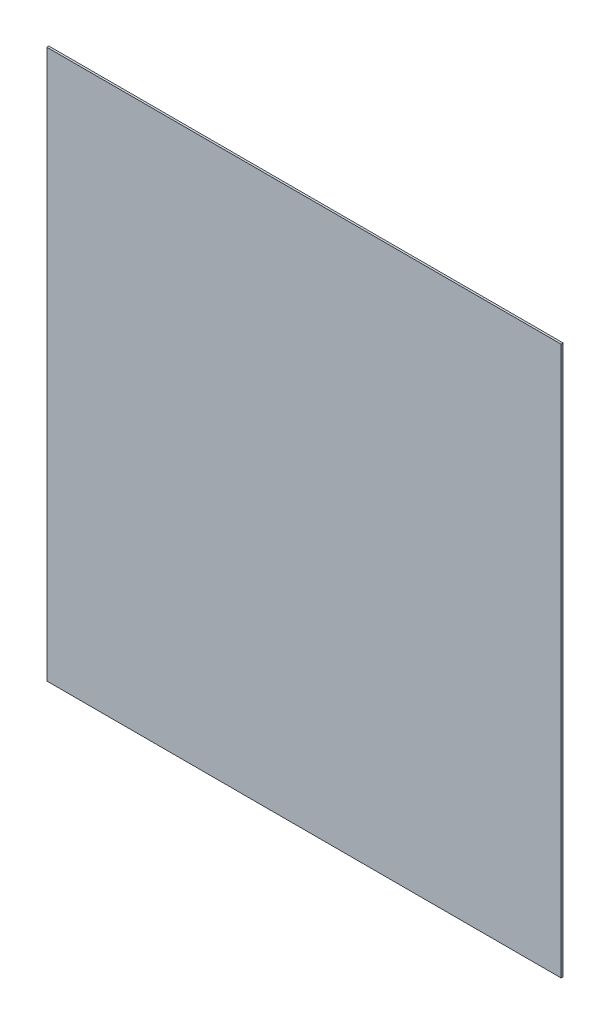
ISO-10303-21;
HEADER;
FILE_DESCRIPTION(('STEP AP214'),'2;1');
FILE_NAME('part.step','',(''),(''),'','','');
FILE_SCHEMA(('AUTOMOTIVE_DESIGN { 1 0 10303 214 1 1 1 1 }'));
ENDSEC;
DATA;
#1=APPLICATION_CONTEXT('core data for automotive mechanical design processes');
#2=APPLICATION_PROTOCOL_DEFINITION('international standard','automotive_design',2000,#1);
#3=PRODUCT_CONTEXT('',#1,'mechanical');
#4=PRODUCT('Part','Part','',(#3));
#5=PRODUCT_RELATED_PRODUCT_CATEGORY('part','',(#4));
#6=PRODUCT_DEFINITION_FORMATION('','',#4);
#7=PRODUCT_DEFINITION_CONTEXT('part definition',#1,'design');
#8=PRODUCT_DEFINITION('design','',#6,#7);
#9=PRODUCT_DEFINITION_SHAPE('','',#8);
#10=(LENGTH_UNIT() NAMED_UNIT(*) SI_UNIT(.MILLI.,.METRE.));
#11=(NAMED_UNIT(*) PLANE_ANGLE_UNIT() SI_UNIT($,.RADIAN.));
#12=(NAMED_UNIT(*) SI_UNIT($,.STERADIAN.) SOLID_ANGLE_UNIT());
#13=UNCERTAINTY_MEASURE_WITH_UNIT(LENGTH_MEASURE(1.E-05),#10,'distance_accuracy_value','');
#14=(GEOMETRIC_REPRESENTATION_CONTEXT(3) GLOBAL_UNCERTAINTY_ASSIGNED_CONTEXT((#13)) GLOBAL_UNIT_ASSIGNED_CONTEXT((#10,
#11,#12)) REPRESENTATION_CONTEXT('',''));
#15=CARTESIAN_POINT('',(0.,0.,0.));
#16=DIRECTION('',(0.,0.,1.));
#17=DIRECTION('',(1.,0.,0.));
#18=AXIS2_PLACEMENT_3D('',#15,#16,#17);
#19=CARTESIAN_POINT('',(241.80799865722,158.75,0.41148));
#20=DIRECTION('',(0.,0.,1.));
#21=DIRECTION('',(1.,0.,0.));
#22=AXIS2_PLACEMENT_3D('',#19,#20,#21);
#23=PLANE('',#22);
#24=DIRECTION('',(1.,0.,0.));
#25=VECTOR('',#24,1.);
#26=CARTESIAN_POINT('',(241.80799865722,49.784000396729,0.41148));
#27=LINE('',#26,#25);
#28=CARTESIAN_POINT('',(241.80799865722,49.784000396729,0.41148));
#29=VERTEX_POINT('',#28);
#30=CARTESIAN_POINT('',(139.69999694824,49.784000396729,0.41148));
#31=VERTEX_POINT('',#30);
#32=EDGE_CURVE('E53',#29,#31,#27,.F.);
#33=ORIENTED_EDGE('',*,*,#32,.F.);
#34=DIRECTION('',(0.,1.,0.));
#35=VECTOR('',#34,1.);
#36=CARTESIAN_POINT('',(241.80799865722,158.75,0.41148));
#37=LINE('',#36,#35);
#38=CARTESIAN_POINT('',(241.80799865722,158.75,0.41148));
#39=VERTEX_POINT('',#38);
#40=EDGE_CURVE('E68',#39,#29,#37,.F.);
#41=ORIENTED_EDGE('',*,*,#40,.F.);
#42=DIRECTION('',(1.,0.,0.));
#43=VECTOR('',#42,1.);
#44=CARTESIAN_POINT('',(139.69999694824,158.75,0.41148));
#45=LINE('',#44,#43);
#46=CARTESIAN_POINT('',(139.69999694824,158.75,0.41148));
#47=VERTEX_POINT('',#46);
#48=EDGE_CURVE('E20',#47,#39,#45,.T.);
#49=ORIENTED_EDGE('',*,*,#48,.F.);
#50=DIRECTION('',(0.,1.,0.));
#51=VECTOR('',#50,1.);
#52=CARTESIAN_POINT('',(139.69999694824,49.784000396729,0.41148));
#53=LINE('',#52,#51);
#54=EDGE_CURVE('E58',#31,#47,#53,.T.);
#55=ORIENTED_EDGE('',*,*,#54,.F.);
#56=EDGE_LOOP('',(#33,#41,#49,#55));
#57=FACE_BOUND('',#56,.T.);
#58=ADVANCED_FACE('F17',(#57),#23,.T.);
#59=CARTESIAN_POINT('',(139.69999694824,158.75,0.));
#60=DIRECTION('',(0.,1.,0.));
#61=DIRECTION('',(0.,0.,1.));
#62=AXIS2_PLACEMENT_3D('',#59,#60,#61);
#63=PLANE('',#62);
#64=DIRECTION('',(0.,0.,-1.));
#65=VECTOR('',#64,1.);
#66=CARTESIAN_POINT('',(241.80799865722,158.75,0.));
#67=LINE('',#66,#65);
#68=CARTESIAN_POINT('',(241.80799865722,158.75,0.));
#69=VERTEX_POINT('',#68);
#70=EDGE_CURVE('E79',#69,#39,#67,.F.);
#71=ORIENTED_EDGE('',*,*,#70,.F.);
#72=DIRECTION('',(1.,0.,0.));
#73=VECTOR('',#72,1.);
#74=CARTESIAN_POINT('',(241.80799865722,158.75,0.));
#75=LINE('',#74,#73);
#76=CARTESIAN_POINT('',(139.69999694824,158.75,0.));
#77=VERTEX_POINT('',#76);
#78=EDGE_CURVE('E74',#69,#77,#75,.F.);
#79=ORIENTED_EDGE('',*,*,#78,.T.);
#80=DIRECTION('',(0.,0.,1.));
#81=VECTOR('',#80,1.);
#82=CARTESIAN_POINT('',(139.69999694824,158.75,0.));
#83=LINE('',#82,#81);
#84=EDGE_CURVE('E63',#47,#77,#83,.F.);
#85=ORIENTED_EDGE('',*,*,#84,.F.);
#86=ORIENTED_EDGE('',*,*,#48,.T.);
#87=EDGE_LOOP('',(#71,#79,#85,#86));
#88=FACE_BOUND('',#87,.T.);
#89=ADVANCED_FACE('F73',(#88),#63,.T.);
#90=CARTESIAN_POINT('',(139.69999694824,49.784000396729,0.));
#91=DIRECTION('',(-1.,0.,0.));
#92=DIRECTION('',(0.,0.,1.));
#93=AXIS2_PLACEMENT_3D('',#90,#91,#92);
#94=PLANE('',#93);
#95=ORIENTED_EDGE('',*,*,#84,.T.);
#96=DIRECTION('',(0.,1.,0.));
#97=VECTOR('',#96,1.);
#98=CARTESIAN_POINT('',(139.69999694824,158.75,0.));
#99=LINE('',#98,#97);
#100=CARTESIAN_POINT('',(139.69999694824,49.784000396729,0.));
#101=VERTEX_POINT('',#100);
#102=EDGE_CURVE('E84',#77,#101,#99,.F.);
#103=ORIENTED_EDGE('',*,*,#102,.T.);
#104=DIRECTION('',(0.,0.,-1.));
#105=VECTOR('',#104,1.);
#106=CARTESIAN_POINT('',(139.69999694824,49.784000396729,0.));
#107=LINE('',#106,#105);
#108=EDGE_CURVE('E65',#31,#101,#107,.T.);
#109=ORIENTED_EDGE('',*,*,#108,.F.);
#110=ORIENTED_EDGE('',*,*,#54,.T.);
#111=EDGE_LOOP('',(#95,#103,#109,#110));
#112=FACE_BOUND('',#111,.T.);
#113=ADVANCED_FACE('F60',(#112),#94,.T.);
#114=CARTESIAN_POINT('',(241.80799865722,49.784000396729,0.));
#115=DIRECTION('',(0.,-1.,0.));
#116=DIRECTION('',(0.,0.,-1.));
#117=AXIS2_PLACEMENT_3D('',#114,#115,#116);
#118=PLANE('',#117);
#119=ORIENTED_EDGE('',*,*,#108,.T.);
#120=DIRECTION('',(1.,0.,0.));
#121=VECTOR('',#120,1.);
#122=CARTESIAN_POINT('',(241.80799865722,49.784000396729,0.));
#123=LINE('',#122,#121);
#124=CARTESIAN_POINT('',(241.80799865722,49.784000396729,0.));
#125=VERTEX_POINT('',#124);
#126=EDGE_CURVE('E26',#101,#125,#123,.T.);
#127=ORIENTED_EDGE('',*,*,#126,.T.);
#128=DIRECTION('',(0.,0.,-1.));
#129=VECTOR('',#128,1.);
#130=CARTESIAN_POINT('',(241.80799865722,49.784000396729,0.));
#131=LINE('',#130,#129);
#132=EDGE_CURVE('E34',#29,#125,#131,.T.);
#133=ORIENTED_EDGE('',*,*,#132,.F.);
#134=ORIENTED_EDGE('',*,*,#32,.T.);
#135=EDGE_LOOP('',(#119,#127,#133,#134));
#136=FACE_BOUND('',#135,.T.);
#137=ADVANCED_FACE('F88',(#136),#118,.T.);
#138=CARTESIAN_POINT('',(241.80799865722,158.75,0.));
#139=DIRECTION('',(1.,0.,0.));
#140=DIRECTION('',(0.,0.,-1.));
#141=AXIS2_PLACEMENT_3D('',#138,#139,#140);
#142=PLANE('',#141);
#143=ORIENTED_EDGE('',*,*,#132,.T.);
#144=DIRECTION('',(0.,1.,0.));
#145=VECTOR('',#144,1.);
#146=CARTESIAN_POINT('',(241.80799865722,158.75,0.));
#147=LINE('',#146,#145);
#148=EDGE_CURVE('E11',#125,#69,#147,.T.);
#149=ORIENTED_EDGE('',*,*,#148,.T.);
#150=ORIENTED_EDGE('',*,*,#70,.T.);
#151=ORIENTED_EDGE('',*,*,#40,.T.);
#152=EDGE_LOOP('',(#143,#149,#150,#151));
#153=FACE_BOUND('',#152,.T.);
#154=ADVANCED_FACE('F91',(#153),#142,.T.);
#155=CARTESIAN_POINT('',(241.80799865722,158.75,0.));
#156=DIRECTION('',(0.,0.,1.));
#157=DIRECTION('',(1.,0.,0.));
#158=AXIS2_PLACEMENT_3D('',#155,#156,#157);
#159=PLANE('',#158);
#160=ORIENTED_EDGE('',*,*,#126,.F.);
#161=ORIENTED_EDGE('',*,*,#102,.F.);
#162=ORIENTED_EDGE('',*,*,#78,.F.);
#163=ORIENTED_EDGE('',*,*,#148,.F.);
#164=EDGE_LOOP('',(#160,#161,#162,#163));
#165=FACE_BOUND('',#164,.T.);
#166=ADVANCED_FACE('F90',(#165),#159,.F.);
#167=CLOSED_SHELL('',(#58,#89,#113,#137,#154,#166));
#168=MANIFOLD_SOLID_BREP('B1',#167);
#169=ADVANCED_BREP_SHAPE_REPRESENTATION('',(#18,#168),#14);
#170=SHAPE_DEFINITION_REPRESENTATION(#9,#169);
ENDSEC;
END-ISO-10303-21;
